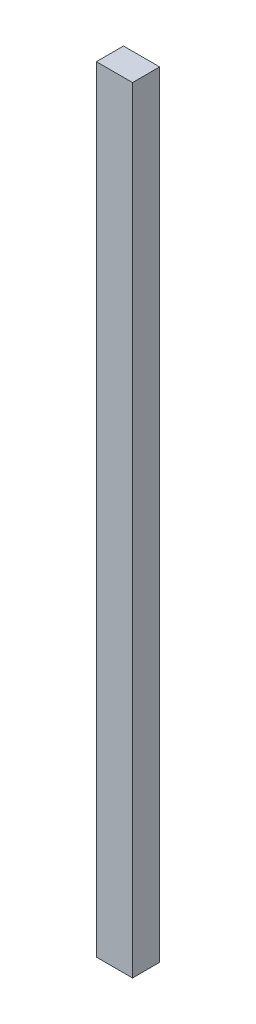
ISO-10303-21;
HEADER;
FILE_DESCRIPTION(('STEP AP214'),'2;1');
FILE_NAME('part.step','',(''),(''),'','','');
FILE_SCHEMA(('AUTOMOTIVE_DESIGN { 1 0 10303 214 1 1 1 1 }'));
ENDSEC;
DATA;
#1=APPLICATION_CONTEXT('core data for automotive mechanical design processes');
#2=APPLICATION_PROTOCOL_DEFINITION('international standard','automotive_design',2000,#1);
#3=PRODUCT_CONTEXT('',#1,'mechanical');
#4=PRODUCT('Part','Part','',(#3));
#5=PRODUCT_RELATED_PRODUCT_CATEGORY('part','',(#4));
#6=PRODUCT_DEFINITION_FORMATION('','',#4);
#7=PRODUCT_DEFINITION_CONTEXT('part definition',#1,'design');
#8=PRODUCT_DEFINITION('design','',#6,#7);
#9=PRODUCT_DEFINITION_SHAPE('','',#8);
#10=(LENGTH_UNIT() NAMED_UNIT(*) SI_UNIT(.MILLI.,.METRE.));
#11=(NAMED_UNIT(*) PLANE_ANGLE_UNIT() SI_UNIT($,.RADIAN.));
#12=(NAMED_UNIT(*) SI_UNIT($,.STERADIAN.) SOLID_ANGLE_UNIT());
#13=UNCERTAINTY_MEASURE_WITH_UNIT(LENGTH_MEASURE(1.E-05),#10,'distance_accuracy_value','');
#14=(GEOMETRIC_REPRESENTATION_CONTEXT(3) GLOBAL_UNCERTAINTY_ASSIGNED_CONTEXT((#13)) GLOBAL_UNIT_ASSIGNED_CONTEXT((#10,
#11,#12)) REPRESENTATION_CONTEXT('',''));
#15=CARTESIAN_POINT('',(0.,0.,0.));
#16=DIRECTION('',(0.,0.,1.));
#17=DIRECTION('',(1.,0.,0.));
#18=AXIS2_PLACEMENT_3D('',#15,#16,#17);
#19=CARTESIAN_POINT('',(0.,544.576,0.));
#20=DIRECTION('',(1.,0.,0.));
#21=DIRECTION('',(0.,0.,-1.));
#22=AXIS2_PLACEMENT_3D('',#19,#20,#21);
#23=PLANE('',#22);
#24=DIRECTION('',(0.,0.,1.));
#25=VECTOR('',#24,1.);
#26=CARTESIAN_POINT('',(0.,0.,0.));
#27=LINE('',#26,#25);
#28=CARTESIAN_POINT('',(0.,0.,-19.05));
#29=VERTEX_POINT('',#28);
#30=CARTESIAN_POINT('',(0.,0.,0.));
#31=VERTEX_POINT('',#30);
#32=EDGE_CURVE('E96',#29,#31,#27,.T.);
#33=ORIENTED_EDGE('',*,*,#32,.T.);
#34=DIRECTION('',(0.,-1.,0.));
#35=VECTOR('',#34,1.);
#36=CARTESIAN_POINT('',(0.,544.576,0.));
#37=LINE('',#36,#35);
#38=CARTESIAN_POINT('',(0.,544.576,0.));
#39=VERTEX_POINT('',#38);
#40=EDGE_CURVE('E11',#39,#31,#37,.T.);
#41=ORIENTED_EDGE('',*,*,#40,.F.);
#42=DIRECTION('',(0.,0.,1.));
#43=VECTOR('',#42,1.);
#44=CARTESIAN_POINT('',(0.,544.576,0.));
#45=LINE('',#44,#43);
#46=CARTESIAN_POINT('',(0.,544.576,-19.05));
#47=VERTEX_POINT('',#46);
#48=EDGE_CURVE('E84',#47,#39,#45,.T.);
#49=ORIENTED_EDGE('',*,*,#48,.F.);
#50=DIRECTION('',(0.,-1.,0.));
#51=VECTOR('',#50,1.);
#52=CARTESIAN_POINT('',(0.,544.576,-19.05));
#53=LINE('',#52,#51);
#54=EDGE_CURVE('E92',#47,#29,#53,.T.);
#55=ORIENTED_EDGE('',*,*,#54,.T.);
#56=EDGE_LOOP('',(#33,#41,#49,#55));
#57=FACE_BOUND('',#56,.T.);
#58=ADVANCED_FACE('F33',(#57),#23,.F.);
#59=CARTESIAN_POINT('',(0.,544.576,0.));
#60=DIRECTION('',(0.,0.,-1.));
#61=DIRECTION('',(-1.,0.,0.));
#62=AXIS2_PLACEMENT_3D('',#59,#60,#61);
#63=PLANE('',#62);
#64=DIRECTION('',(1.,0.,0.));
#65=VECTOR('',#64,1.);
#66=CARTESIAN_POINT('',(0.,0.,0.));
#67=LINE('',#66,#65);
#68=CARTESIAN_POINT('',(25.4,0.,0.));
#69=VERTEX_POINT('',#68);
#70=EDGE_CURVE('E88',#31,#69,#67,.T.);
#71=ORIENTED_EDGE('',*,*,#70,.T.);
#72=DIRECTION('',(0.,-1.,0.));
#73=VECTOR('',#72,1.);
#74=CARTESIAN_POINT('',(25.4,544.576,0.));
#75=LINE('',#74,#73);
#76=CARTESIAN_POINT('',(25.4,544.576,0.));
#77=VERTEX_POINT('',#76);
#78=EDGE_CURVE('E41',#77,#69,#75,.T.);
#79=ORIENTED_EDGE('',*,*,#78,.F.);
#80=DIRECTION('',(1.,0.,0.));
#81=VECTOR('',#80,1.);
#82=CARTESIAN_POINT('',(0.,544.576,0.));
#83=LINE('',#82,#81);
#84=EDGE_CURVE('E79',#39,#77,#83,.T.);
#85=ORIENTED_EDGE('',*,*,#84,.F.);
#86=ORIENTED_EDGE('',*,*,#40,.T.);
#87=EDGE_LOOP('',(#71,#79,#85,#86));
#88=FACE_BOUND('',#87,.T.);
#89=ADVANCED_FACE('F87',(#88),#63,.F.);
#90=CARTESIAN_POINT('',(25.4,544.576,0.));
#91=DIRECTION('',(-1.,0.,0.));
#92=DIRECTION('',(0.,0.,1.));
#93=AXIS2_PLACEMENT_3D('',#90,#91,#92);
#94=PLANE('',#93);
#95=DIRECTION('',(0.,0.,-1.));
#96=VECTOR('',#95,1.);
#97=CARTESIAN_POINT('',(25.4,0.,0.));
#98=LINE('',#97,#96);
#99=CARTESIAN_POINT('',(25.4,0.,-19.05));
#100=VERTEX_POINT('',#99);
#101=EDGE_CURVE('E66',#69,#100,#98,.T.);
#102=ORIENTED_EDGE('',*,*,#101,.T.);
#103=DIRECTION('',(0.,-1.,0.));
#104=VECTOR('',#103,1.);
#105=CARTESIAN_POINT('',(25.4,544.576,-19.05));
#106=LINE('',#105,#104);
#107=CARTESIAN_POINT('',(25.4,544.576,-19.05));
#108=VERTEX_POINT('',#107);
#109=EDGE_CURVE('E89',#108,#100,#106,.T.);
#110=ORIENTED_EDGE('',*,*,#109,.F.);
#111=DIRECTION('',(0.,0.,-1.));
#112=VECTOR('',#111,1.);
#113=CARTESIAN_POINT('',(25.4,544.576,0.));
#114=LINE('',#113,#112);
#115=EDGE_CURVE('E82',#77,#108,#114,.T.);
#116=ORIENTED_EDGE('',*,*,#115,.F.);
#117=ORIENTED_EDGE('',*,*,#78,.T.);
#118=EDGE_LOOP('',(#102,#110,#116,#117));
#119=FACE_BOUND('',#118,.T.);
#120=ADVANCED_FACE('F90',(#119),#94,.F.);
#121=CARTESIAN_POINT('',(0.,544.576,-19.05));
#122=DIRECTION('',(0.,0.,1.));
#123=DIRECTION('',(1.,0.,0.));
#124=AXIS2_PLACEMENT_3D('',#121,#122,#123);
#125=PLANE('',#124);
#126=DIRECTION('',(-1.,0.,0.));
#127=VECTOR('',#126,1.);
#128=CARTESIAN_POINT('',(0.,0.,-19.05));
#129=LINE('',#128,#127);
#130=EDGE_CURVE('E72',#100,#29,#129,.T.);
#131=ORIENTED_EDGE('',*,*,#130,.T.);
#132=ORIENTED_EDGE('',*,*,#54,.F.);
#133=DIRECTION('',(-1.,0.,0.));
#134=VECTOR('',#133,1.);
#135=CARTESIAN_POINT('',(0.,544.576,-19.05));
#136=LINE('',#135,#134);
#137=EDGE_CURVE('E49',#108,#47,#136,.T.);
#138=ORIENTED_EDGE('',*,*,#137,.F.);
#139=ORIENTED_EDGE('',*,*,#109,.T.);
#140=EDGE_LOOP('',(#131,#132,#138,#139));
#141=FACE_BOUND('',#140,.T.);
#142=ADVANCED_FACE('F103',(#141),#125,.F.);
#143=CARTESIAN_POINT('',(0.,544.576,0.));
#144=DIRECTION('',(0.,-1.,0.));
#145=DIRECTION('',(0.,0.,-1.));
#146=AXIS2_PLACEMENT_3D('',#143,#144,#145);
#147=PLANE('',#146);
#148=ORIENTED_EDGE('',*,*,#48,.T.);
#149=ORIENTED_EDGE('',*,*,#84,.T.);
#150=ORIENTED_EDGE('',*,*,#115,.T.);
#151=ORIENTED_EDGE('',*,*,#137,.T.);
#152=EDGE_LOOP('',(#148,#149,#150,#151));
#153=FACE_BOUND('',#152,.T.);
#154=ADVANCED_FACE('F80',(#153),#147,.F.);
#155=CARTESIAN_POINT('',(0.,0.,0.));
#156=DIRECTION('',(0.,-1.,0.));
#157=DIRECTION('',(0.,0.,-1.));
#158=AXIS2_PLACEMENT_3D('',#155,#156,#157);
#159=PLANE('',#158);
#160=ORIENTED_EDGE('',*,*,#32,.F.);
#161=ORIENTED_EDGE('',*,*,#130,.F.);
#162=ORIENTED_EDGE('',*,*,#101,.F.);
#163=ORIENTED_EDGE('',*,*,#70,.F.);
#164=EDGE_LOOP('',(#160,#161,#162,#163));
#165=FACE_BOUND('',#164,.T.);
#166=ADVANCED_FACE('F106',(#165),#159,.T.);
#167=CLOSED_SHELL('',(#58,#89,#120,#142,#154,#166));
#168=MANIFOLD_SOLID_BREP('B2',#167);
#169=ADVANCED_BREP_SHAPE_REPRESENTATION('',(#18,#168),#14);
#170=SHAPE_DEFINITION_REPRESENTATION(#9,#169);
ENDSEC;
END-ISO-10303-21;
